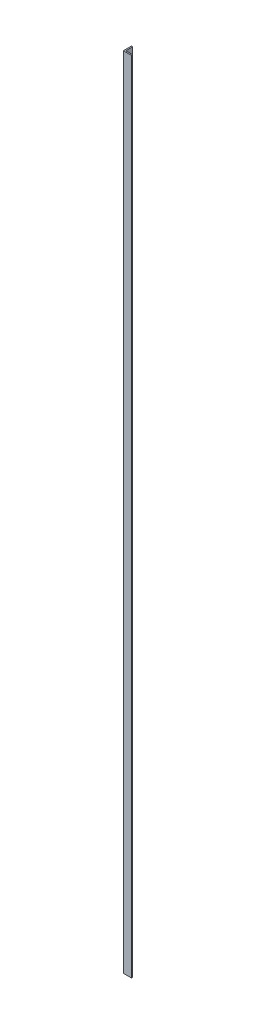
ISO-10303-21;
HEADER;
FILE_DESCRIPTION(('STEP AP214'),'2;1');
FILE_NAME('part.step','',(''),(''),'','','');
FILE_SCHEMA(('AUTOMOTIVE_DESIGN { 1 0 10303 214 1 1 1 1 }'));
ENDSEC;
DATA;
#1=APPLICATION_CONTEXT('core data for automotive mechanical design processes');
#2=APPLICATION_PROTOCOL_DEFINITION('international standard','automotive_design',2000,#1);
#3=PRODUCT_CONTEXT('',#1,'mechanical');
#4=PRODUCT('Part','Part','',(#3));
#5=PRODUCT_RELATED_PRODUCT_CATEGORY('part','',(#4));
#6=PRODUCT_DEFINITION_FORMATION('','',#4);
#7=PRODUCT_DEFINITION_CONTEXT('part definition',#1,'design');
#8=PRODUCT_DEFINITION('design','',#6,#7);
#9=PRODUCT_DEFINITION_SHAPE('','',#8);
#10=(LENGTH_UNIT() NAMED_UNIT(*) SI_UNIT(.MILLI.,.METRE.));
#11=(NAMED_UNIT(*) PLANE_ANGLE_UNIT() SI_UNIT($,.RADIAN.));
#12=(NAMED_UNIT(*) SI_UNIT($,.STERADIAN.) SOLID_ANGLE_UNIT());
#13=UNCERTAINTY_MEASURE_WITH_UNIT(LENGTH_MEASURE(1.E-05),#10,'distance_accuracy_value','');
#14=(GEOMETRIC_REPRESENTATION_CONTEXT(3) GLOBAL_UNCERTAINTY_ASSIGNED_CONTEXT((#13)) GLOBAL_UNIT_ASSIGNED_CONTEXT((#10,
#11,#12)) REPRESENTATION_CONTEXT('',''));
#15=CARTESIAN_POINT('',(0.,0.,0.));
#16=DIRECTION('',(0.,0.,1.));
#17=DIRECTION('',(1.,0.,0.));
#18=AXIS2_PLACEMENT_3D('',#15,#16,#17);
#19=CARTESIAN_POINT('',(-1.77635683940025E-11,4978.4,-4.44089209850063E-12));
#20=DIRECTION('',(0.,0.,-1.));
#21=DIRECTION('',(-0.999999999999996,0.,0.));
#22=AXIS2_PLACEMENT_3D('',#19,#20,#21);
#23=PLANE('',#22);
#24=DIRECTION('',(0.999999999999996,0.,0.));
#25=VECTOR('',#24,1.);
#26=CARTESIAN_POINT('',(0.,0.,0.));
#27=LINE('',#26,#25);
#28=CARTESIAN_POINT('',(0.,0.,0.));
#29=VERTEX_POINT('',#28);
#30=CARTESIAN_POINT('',(50.8000000000002,0.,0.));
#31=VERTEX_POINT('',#30);
#32=EDGE_CURVE('E120',#29,#31,#27,.T.);
#33=ORIENTED_EDGE('',*,*,#32,.T.);
#34=DIRECTION('',(0.,-1.,0.));
#35=VECTOR('',#34,1.);
#36=CARTESIAN_POINT('',(50.799999999982,4978.4,-4.44089209850063E-12));
#37=LINE('',#36,#35);
#38=CARTESIAN_POINT('',(50.799999999982,4978.4,-4.44089209850063E-12));
#39=VERTEX_POINT('',#38);
#40=EDGE_CURVE('E11',#39,#31,#37,.T.);
#41=ORIENTED_EDGE('',*,*,#40,.F.);
#42=DIRECTION('',(0.999999999999996,0.,0.));
#43=VECTOR('',#42,1.);
#44=CARTESIAN_POINT('',(-1.77635683940025E-11,4978.4,-4.44089209850063E-12));
#45=LINE('',#44,#43);
#46=CARTESIAN_POINT('',(-1.77635683940025E-11,4978.4,-4.44089209850063E-12));
#47=VERTEX_POINT('',#46);
#48=EDGE_CURVE('E130',#47,#39,#45,.T.);
#49=ORIENTED_EDGE('',*,*,#48,.F.);
#50=DIRECTION('',(0.,-1.,0.));
#51=VECTOR('',#50,1.);
#52=CARTESIAN_POINT('',(-1.77635683940025E-11,4978.4,-4.44089209850063E-12));
#53=LINE('',#52,#51);
#54=EDGE_CURVE('E116',#47,#29,#53,.T.);
#55=ORIENTED_EDGE('',*,*,#54,.T.);
#56=EDGE_LOOP('',(#33,#41,#49,#55));
#57=FACE_BOUND('',#56,.T.);
#58=ADVANCED_FACE('F36',(#57),#23,.F.);
#59=CARTESIAN_POINT('',(50.799999999982,4978.4,-4.44089209850063E-12));
#60=DIRECTION('',(-0.999999999999996,0.,0.));
#61=DIRECTION('',(0.,0.,1.));
#62=AXIS2_PLACEMENT_3D('',#59,#60,#61);
#63=PLANE('',#62);
#64=DIRECTION('',(0.,0.,-1.));
#65=VECTOR('',#64,1.);
#66=CARTESIAN_POINT('',(50.8000000000002,0.,0.));
#67=LINE('',#66,#65);
#68=CARTESIAN_POINT('',(50.8000000000002,0.,-7.62000000000018));
#69=VERTEX_POINT('',#68);
#70=EDGE_CURVE('E123',#31,#69,#67,.T.);
#71=ORIENTED_EDGE('',*,*,#70,.T.);
#72=DIRECTION('',(0.,-1.,0.));
#73=VECTOR('',#72,1.);
#74=CARTESIAN_POINT('',(50.799999999982,4978.4,-7.62000000000462));
#75=LINE('',#74,#73);
#76=CARTESIAN_POINT('',(50.799999999982,4978.4,-7.62000000000462));
#77=VERTEX_POINT('',#76);
#78=EDGE_CURVE('E44',#77,#69,#75,.T.);
#79=ORIENTED_EDGE('',*,*,#78,.F.);
#80=DIRECTION('',(0.,0.,-1.));
#81=VECTOR('',#80,1.);
#82=CARTESIAN_POINT('',(50.799999999982,4978.4,-4.44089209850063E-12));
#83=LINE('',#82,#81);
#84=EDGE_CURVE('E89',#39,#77,#83,.T.);
#85=ORIENTED_EDGE('',*,*,#84,.F.);
#86=ORIENTED_EDGE('',*,*,#40,.T.);
#87=EDGE_LOOP('',(#71,#79,#85,#86));
#88=FACE_BOUND('',#87,.T.);
#89=ADVANCED_FACE('F154',(#88),#63,.F.);
#90=CARTESIAN_POINT('',(7.61999999998197,4978.4,-7.62000000000462));
#91=DIRECTION('',(0.,0.,1.));
#92=DIRECTION('',(0.999999999999996,0.,0.));
#93=AXIS2_PLACEMENT_3D('',#90,#91,#92);
#94=PLANE('',#93);
#95=DIRECTION('',(-0.999999999999996,0.,0.));
#96=VECTOR('',#95,1.);
#97=CARTESIAN_POINT('',(7.62000000000018,0.,-7.62000000000018));
#98=LINE('',#97,#96);
#99=CARTESIAN_POINT('',(7.62000000000018,0.,-7.62000000000018));
#100=VERTEX_POINT('',#99);
#101=EDGE_CURVE('E125',#69,#100,#98,.T.);
#102=ORIENTED_EDGE('',*,*,#101,.T.);
#103=DIRECTION('',(0.,-1.,0.));
#104=VECTOR('',#103,1.);
#105=CARTESIAN_POINT('',(7.61999999998197,4978.4,-7.62000000000462));
#106=LINE('',#105,#104);
#107=CARTESIAN_POINT('',(7.61999999998197,4978.4,-7.62000000000462));
#108=VERTEX_POINT('',#107);
#109=EDGE_CURVE('E111',#108,#100,#106,.T.);
#110=ORIENTED_EDGE('',*,*,#109,.F.);
#111=DIRECTION('',(-0.999999999999996,0.,0.));
#112=VECTOR('',#111,1.);
#113=CARTESIAN_POINT('',(7.61999999998197,4978.4,-7.62000000000462));
#114=LINE('',#113,#112);
#115=EDGE_CURVE('E102',#77,#108,#114,.T.);
#116=ORIENTED_EDGE('',*,*,#115,.F.);
#117=ORIENTED_EDGE('',*,*,#78,.T.);
#118=EDGE_LOOP('',(#102,#110,#116,#117));
#119=FACE_BOUND('',#118,.T.);
#120=ADVANCED_FACE('F136',(#119),#94,.F.);
#121=CARTESIAN_POINT('',(7.61999999998197,4978.4,-7.62000000000462));
#122=DIRECTION('',(-0.999999999999996,0.,0.));
#123=DIRECTION('',(0.,0.,1.));
#124=AXIS2_PLACEMENT_3D('',#121,#122,#123);
#125=PLANE('',#124);
#126=DIRECTION('',(0.,0.,-1.));
#127=VECTOR('',#126,1.);
#128=CARTESIAN_POINT('',(7.62000000000018,0.,-7.62000000000018));
#129=LINE('',#128,#127);
#130=CARTESIAN_POINT('',(7.62000000000018,0.,-50.8000000000022));
#131=VERTEX_POINT('',#130);
#132=EDGE_CURVE('E110',#100,#131,#129,.T.);
#133=ORIENTED_EDGE('',*,*,#132,.T.);
#134=DIRECTION('',(0.,-1.,0.));
#135=VECTOR('',#134,1.);
#136=CARTESIAN_POINT('',(7.61999999998197,4978.4,-50.8000000000046));
#137=LINE('',#136,#135);
#138=CARTESIAN_POINT('',(7.61999999998197,4978.4,-50.8000000000046));
#139=VERTEX_POINT('',#138);
#140=EDGE_CURVE('E107',#139,#131,#137,.T.);
#141=ORIENTED_EDGE('',*,*,#140,.F.);
#142=DIRECTION('',(0.,0.,-1.));
#143=VECTOR('',#142,1.);
#144=CARTESIAN_POINT('',(7.61999999998197,4978.4,-7.62000000000462));
#145=LINE('',#144,#143);
#146=EDGE_CURVE('E96',#108,#139,#145,.T.);
#147=ORIENTED_EDGE('',*,*,#146,.F.);
#148=ORIENTED_EDGE('',*,*,#109,.T.);
#149=EDGE_LOOP('',(#133,#141,#147,#148));
#150=FACE_BOUND('',#149,.T.);
#151=ADVANCED_FACE('F108',(#150),#125,.F.);
#152=CARTESIAN_POINT('',(-1.77635683940025E-11,4978.4,-50.8000000000046));
#153=DIRECTION('',(0.,0.,1.));
#154=DIRECTION('',(0.999999999999996,0.,0.));
#155=AXIS2_PLACEMENT_3D('',#152,#153,#154);
#156=PLANE('',#155);
#157=DIRECTION('',(-0.999999999999996,0.,0.));
#158=VECTOR('',#157,1.);
#159=CARTESIAN_POINT('',(0.,0.,-50.8000000000022));
#160=LINE('',#159,#158);
#161=CARTESIAN_POINT('',(0.,0.,-50.8000000000022));
#162=VERTEX_POINT('',#161);
#163=EDGE_CURVE('E75',#131,#162,#160,.T.);
#164=ORIENTED_EDGE('',*,*,#163,.T.);
#165=DIRECTION('',(0.,-1.,0.));
#166=VECTOR('',#165,1.);
#167=CARTESIAN_POINT('',(-1.77635683940025E-11,4978.4,-50.8000000000046));
#168=LINE('',#167,#166);
#169=CARTESIAN_POINT('',(-1.77635683940025E-11,4978.4,-50.8000000000046));
#170=VERTEX_POINT('',#169);
#171=EDGE_CURVE('E112',#170,#162,#168,.T.);
#172=ORIENTED_EDGE('',*,*,#171,.F.);
#173=DIRECTION('',(-0.999999999999996,0.,0.));
#174=VECTOR('',#173,1.);
#175=CARTESIAN_POINT('',(-1.77635683940025E-11,4978.4,-50.8000000000046));
#176=LINE('',#175,#174);
#177=EDGE_CURVE('E100',#139,#170,#176,.T.);
#178=ORIENTED_EDGE('',*,*,#177,.F.);
#179=ORIENTED_EDGE('',*,*,#140,.T.);
#180=EDGE_LOOP('',(#164,#172,#178,#179));
#181=FACE_BOUND('',#180,.T.);
#182=ADVANCED_FACE('F114',(#181),#156,.F.);
#183=CARTESIAN_POINT('',(-1.77635683940025E-11,4978.4,-4.44089209850063E-12));
#184=DIRECTION('',(0.999999999999996,0.,0.));
#185=DIRECTION('',(0.,0.,-1.));
#186=AXIS2_PLACEMENT_3D('',#183,#184,#185);
#187=PLANE('',#186);
#188=DIRECTION('',(0.,0.,1.));
#189=VECTOR('',#188,1.);
#190=CARTESIAN_POINT('',(0.,0.,0.));
#191=LINE('',#190,#189);
#192=EDGE_CURVE('E81',#162,#29,#191,.T.);
#193=ORIENTED_EDGE('',*,*,#192,.T.);
#194=ORIENTED_EDGE('',*,*,#54,.F.);
#195=DIRECTION('',(0.,0.,1.));
#196=VECTOR('',#195,1.);
#197=CARTESIAN_POINT('',(-1.77635683940025E-11,4978.4,-4.44089209850063E-12));
#198=LINE('',#197,#196);
#199=EDGE_CURVE('E52',#170,#47,#198,.T.);
#200=ORIENTED_EDGE('',*,*,#199,.F.);
#201=ORIENTED_EDGE('',*,*,#171,.T.);
#202=EDGE_LOOP('',(#193,#194,#200,#201));
#203=FACE_BOUND('',#202,.T.);
#204=ADVANCED_FACE('F143',(#203),#187,.F.);
#205=CARTESIAN_POINT('',(-1.77635683940025E-11,4978.4,-4.44089209850063E-12));
#206=DIRECTION('',(0.,1.,0.));
#207=DIRECTION('',(0.,0.,1.));
#208=AXIS2_PLACEMENT_3D('',#205,#206,#207);
#209=PLANE('',#208);
#210=ORIENTED_EDGE('',*,*,#48,.T.);
#211=ORIENTED_EDGE('',*,*,#84,.T.);
#212=ORIENTED_EDGE('',*,*,#115,.T.);
#213=ORIENTED_EDGE('',*,*,#146,.T.);
#214=ORIENTED_EDGE('',*,*,#177,.T.);
#215=ORIENTED_EDGE('',*,*,#199,.T.);
#216=EDGE_LOOP('',(#210,#211,#212,#213,#214,#215));
#217=FACE_BOUND('',#216,.T.);
#218=ADVANCED_FACE('F98',(#217),#209,.T.);
#219=CARTESIAN_POINT('',(0.,0.,0.));
#220=DIRECTION('',(0.,1.,0.));
#221=DIRECTION('',(0.,0.,1.));
#222=AXIS2_PLACEMENT_3D('',#219,#220,#221);
#223=PLANE('',#222);
#224=ORIENTED_EDGE('',*,*,#32,.F.);
#225=ORIENTED_EDGE('',*,*,#192,.F.);
#226=ORIENTED_EDGE('',*,*,#163,.F.);
#227=ORIENTED_EDGE('',*,*,#132,.F.);
#228=ORIENTED_EDGE('',*,*,#101,.F.);
#229=ORIENTED_EDGE('',*,*,#70,.F.);
#230=EDGE_LOOP('',(#224,#225,#226,#227,#228,#229));
#231=FACE_BOUND('',#230,.T.);
#232=ADVANCED_FACE('F139',(#231),#223,.F.);
#233=CLOSED_SHELL('',(#58,#89,#120,#151,#182,#204,#218,#232));
#234=MANIFOLD_SOLID_BREP('B2',#233);
#235=ADVANCED_BREP_SHAPE_REPRESENTATION('',(#18,#234),#14);
#236=SHAPE_DEFINITION_REPRESENTATION(#9,#235);
ENDSEC;
END-ISO-10303-21;
